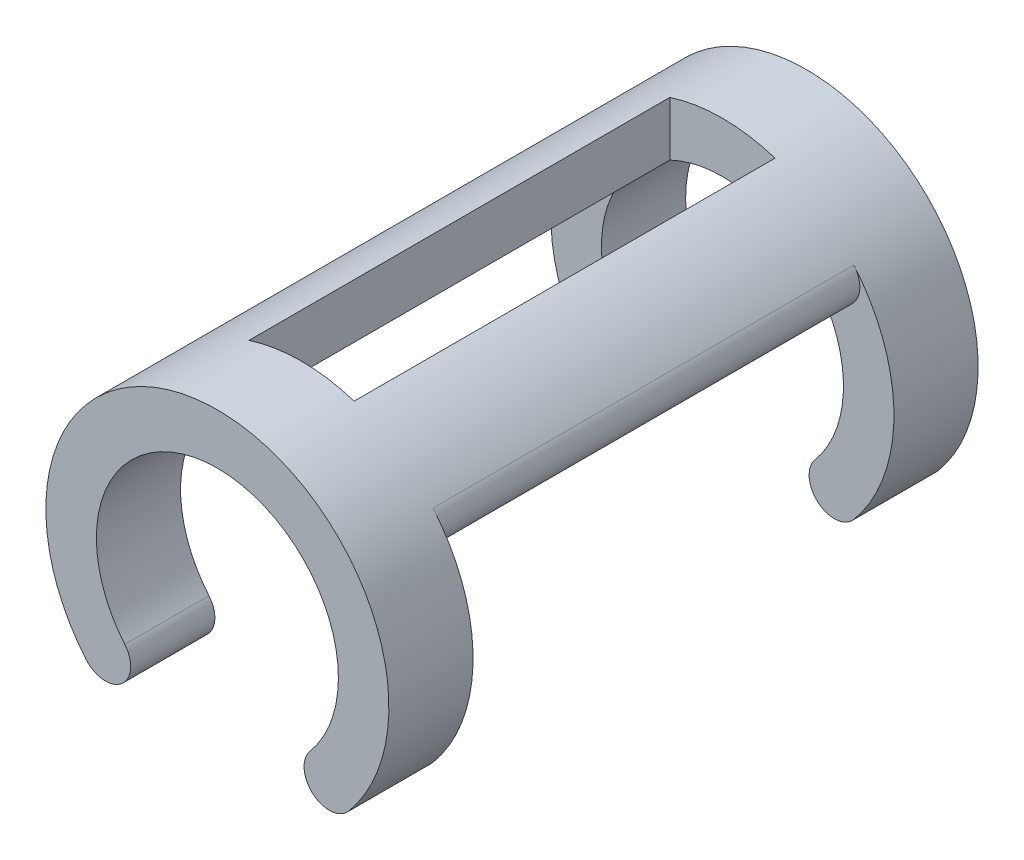
ISO-10303-21;
HEADER;
FILE_DESCRIPTION(('STEP AP214'),'2;1');
FILE_NAME('part.step','',(''),(''),'','','');
FILE_SCHEMA(('AUTOMOTIVE_DESIGN { 1 0 10303 214 1 1 1 1 }'));
ENDSEC;
DATA;
#1=APPLICATION_CONTEXT('core data for automotive mechanical design processes');
#2=APPLICATION_PROTOCOL_DEFINITION('international standard','automotive_design',2000,#1);
#3=PRODUCT_CONTEXT('',#1,'mechanical');
#4=PRODUCT('Part','Part','',(#3));
#5=PRODUCT_RELATED_PRODUCT_CATEGORY('part','',(#4));
#6=PRODUCT_DEFINITION_FORMATION('','',#4);
#7=PRODUCT_DEFINITION_CONTEXT('part definition',#1,'design');
#8=PRODUCT_DEFINITION('design','',#6,#7);
#9=PRODUCT_DEFINITION_SHAPE('','',#8);
#10=(LENGTH_UNIT() NAMED_UNIT(*) SI_UNIT(.MILLI.,.METRE.));
#11=(NAMED_UNIT(*) PLANE_ANGLE_UNIT() SI_UNIT($,.RADIAN.));
#12=(NAMED_UNIT(*) SI_UNIT($,.STERADIAN.) SOLID_ANGLE_UNIT());
#13=UNCERTAINTY_MEASURE_WITH_UNIT(LENGTH_MEASURE(1.E-05),#10,'distance_accuracy_value','');
#14=(GEOMETRIC_REPRESENTATION_CONTEXT(3) GLOBAL_UNCERTAINTY_ASSIGNED_CONTEXT((#13)) GLOBAL_UNIT_ASSIGNED_CONTEXT((#10,
#11,#12)) REPRESENTATION_CONTEXT('',''));
#15=CARTESIAN_POINT('',(0.,0.,0.));
#16=DIRECTION('',(0.,0.,1.));
#17=DIRECTION('',(1.,0.,0.));
#18=AXIS2_PLACEMENT_3D('',#15,#16,#17);
#19=CARTESIAN_POINT('',(0.,0.,7.));
#20=DIRECTION('',(0.,0.,-1.));
#21=DIRECTION('',(-1.,0.,0.));
#22=AXIS2_PLACEMENT_3D('',#19,#20,#21);
#23=CYLINDRICAL_SURFACE('',#22,4.075);
#24=CARTESIAN_POINT('',(0.,0.,5.));
#25=DIRECTION('',(0.,0.,-1.));
#26=DIRECTION('',(-1.,0.,0.));
#27=AXIS2_PLACEMENT_3D('',#24,#25,#26);
#28=CIRCLE('',#27,4.075);
#29=CARTESIAN_POINT('',(-3.11900642441657,-2.62248430394696,5.));
#30=VERTEX_POINT('',#29);
#31=CARTESIAN_POINT('',(-3.12425265641117,2.61623208811981,5.));
#32=VERTEX_POINT('',#31);
#33=EDGE_CURVE('E236',#30,#32,#28,.T.);
#34=ORIENTED_EDGE('',*,*,#33,.F.);
#35=DIRECTION('',(0.,0.,-1.));
#36=VECTOR('',#35,1.);
#37=CARTESIAN_POINT('',(-3.11900642441657,-2.62248430394696,7.));
#38=LINE('',#37,#36);
#39=CARTESIAN_POINT('',(-3.11900642441657,-2.62248430394696,7.));
#40=VERTEX_POINT('',#39);
#41=EDGE_CURVE('E292',#30,#40,#38,.F.);
#42=ORIENTED_EDGE('',*,*,#41,.T.);
#43=CARTESIAN_POINT('',(0.,0.,7.));
#44=DIRECTION('',(0.,0.,1.));
#45=DIRECTION('',(1.,0.,0.));
#46=AXIS2_PLACEMENT_3D('',#43,#44,#45);
#47=CIRCLE('',#46,4.075);
#48=CARTESIAN_POINT('',(3.11900642441657,-2.62248430394696,7.));
#49=VERTEX_POINT('',#48);
#50=EDGE_CURVE('E250',#49,#40,#47,.T.);
#51=ORIENTED_EDGE('',*,*,#50,.F.);
#52=DIRECTION('',(0.,0.,-1.));
#53=VECTOR('',#52,1.);
#54=CARTESIAN_POINT('',(3.11900642441657,-2.62248430394696,7.));
#55=LINE('',#54,#53);
#56=CARTESIAN_POINT('',(3.11900642441657,-2.62248430394696,5.));
#57=VERTEX_POINT('',#56);
#58=EDGE_CURVE('E288',#49,#57,#55,.T.);
#59=ORIENTED_EDGE('',*,*,#58,.T.);
#60=CARTESIAN_POINT('',(3.12425265641117,2.61623208811981,5.));
#61=VERTEX_POINT('',#60);
#62=EDGE_CURVE('E231',#61,#57,#28,.T.);
#63=ORIENTED_EDGE('',*,*,#62,.F.);
#64=DIRECTION('',(0.,0.,-1.));
#65=VECTOR('',#64,1.);
#66=CARTESIAN_POINT('',(3.12425265641117,2.61623208811981,7.));
#67=LINE('',#66,#65);
#68=CARTESIAN_POINT('',(3.12425265641117,2.61623208811981,-5.));
#69=VERTEX_POINT('',#68);
#70=EDGE_CURVE('E273',#61,#69,#67,.T.);
#71=ORIENTED_EDGE('',*,*,#70,.T.);
#72=CARTESIAN_POINT('',(0.,0.,-5.));
#73=DIRECTION('',(0.,0.,-1.));
#74=DIRECTION('',(-1.,0.,0.));
#75=AXIS2_PLACEMENT_3D('',#72,#73,#74);
#76=CIRCLE('',#75,4.075);
#77=CARTESIAN_POINT('',(3.11900642441657,-2.62248430394696,-5.));
#78=VERTEX_POINT('',#77);
#79=EDGE_CURVE('E237',#69,#78,#76,.T.);
#80=ORIENTED_EDGE('',*,*,#79,.T.);
#81=DIRECTION('',(0.,0.,-1.));
#82=VECTOR('',#81,1.);
#83=CARTESIAN_POINT('',(3.11900642441657,-2.62248430394696,7.));
#84=LINE('',#83,#82);
#85=CARTESIAN_POINT('',(3.11900642441657,-2.62248430394696,-7.));
#86=VERTEX_POINT('',#85);
#87=EDGE_CURVE('E281',#78,#86,#84,.T.);
#88=ORIENTED_EDGE('',*,*,#87,.T.);
#89=CARTESIAN_POINT('',(0.,0.,-7.));
#90=DIRECTION('',(0.,0.,1.));
#91=DIRECTION('',(1.,0.,0.));
#92=AXIS2_PLACEMENT_3D('',#89,#90,#91);
#93=CIRCLE('',#92,4.075);
#94=CARTESIAN_POINT('',(-3.11900642441657,-2.62248430394696,-7.));
#95=VERTEX_POINT('',#94);
#96=EDGE_CURVE('E246',#86,#95,#93,.T.);
#97=ORIENTED_EDGE('',*,*,#96,.T.);
#98=DIRECTION('',(0.,0.,-1.));
#99=VECTOR('',#98,1.);
#100=CARTESIAN_POINT('',(-3.11900642441657,-2.62248430394696,7.));
#101=LINE('',#100,#99);
#102=CARTESIAN_POINT('',(-3.11900642441657,-2.62248430394696,-5.));
#103=VERTEX_POINT('',#102);
#104=EDGE_CURVE('E284',#95,#103,#101,.F.);
#105=ORIENTED_EDGE('',*,*,#104,.T.);
#106=CARTESIAN_POINT('',(-3.12425265641117,2.61623208811981,-5.));
#107=VERTEX_POINT('',#106);
#108=EDGE_CURVE('E235',#103,#107,#76,.T.);
#109=ORIENTED_EDGE('',*,*,#108,.T.);
#110=DIRECTION('',(0.,0.,-1.));
#111=VECTOR('',#110,1.);
#112=CARTESIAN_POINT('',(-3.12425265641117,2.61623208811981,7.));
#113=LINE('',#112,#111);
#114=EDGE_CURVE('E277',#107,#32,#113,.F.);
#115=ORIENTED_EDGE('',*,*,#114,.T.);
#116=EDGE_LOOP('',(#34,#42,#51,#59,#63,#71,#80,#88,#97,#105,#109,#115));
#117=FACE_BOUND('',#116,.T.);
#118=CARTESIAN_POINT('',(0.,0.,-5.));
#119=DIRECTION('',(0.,0.,1.));
#120=DIRECTION('',(1.,0.,0.));
#121=AXIS2_PLACEMENT_3D('',#118,#119,#120);
#122=CIRCLE('',#121,4.075);
#123=CARTESIAN_POINT('',(1.25,3.87854676393105,-5.));
#124=VERTEX_POINT('',#123);
#125=CARTESIAN_POINT('',(-1.25,3.87854676393105,-5.));
#126=VERTEX_POINT('',#125);
#127=EDGE_CURVE('E209',#124,#126,#122,.T.);
#128=ORIENTED_EDGE('',*,*,#127,.F.);
#129=DIRECTION('',(0.,0.,-1.));
#130=VECTOR('',#129,1.);
#131=CARTESIAN_POINT('',(1.25,3.87854676393105,7.));
#132=LINE('',#131,#130);
#133=CARTESIAN_POINT('',(1.25,3.87854676393105,5.));
#134=VERTEX_POINT('',#133);
#135=EDGE_CURVE('E197',#134,#124,#132,.T.);
#136=ORIENTED_EDGE('',*,*,#135,.F.);
#137=CARTESIAN_POINT('',(0.,0.,5.));
#138=DIRECTION('',(0.,0.,-1.));
#139=DIRECTION('',(-1.,0.,0.));
#140=AXIS2_PLACEMENT_3D('',#137,#138,#139);
#141=CIRCLE('',#140,4.075);
#142=CARTESIAN_POINT('',(-1.25,3.87854676393105,5.));
#143=VERTEX_POINT('',#142);
#144=EDGE_CURVE('E208',#143,#134,#141,.T.);
#145=ORIENTED_EDGE('',*,*,#144,.F.);
#146=DIRECTION('',(0.,0.,-1.));
#147=VECTOR('',#146,1.);
#148=CARTESIAN_POINT('',(-1.25,3.87854676393105,7.));
#149=LINE('',#148,#147);
#150=EDGE_CURVE('E217',#126,#143,#149,.F.);
#151=ORIENTED_EDGE('',*,*,#150,.F.);
#152=EDGE_LOOP('',(#128,#136,#145,#151));
#153=FACE_BOUND('',#152,.T.);
#154=ADVANCED_FACE('F45',(#117,#153),#23,.T.);
#155=CARTESIAN_POINT('',(0.,0.,7.));
#156=DIRECTION('',(0.,0.,-1.));
#157=DIRECTION('',(-1.,0.,0.));
#158=AXIS2_PLACEMENT_3D('',#155,#156,#157);
#159=CYLINDRICAL_SURFACE('',#158,2.875);
#160=CARTESIAN_POINT('',(0.,0.,7.));
#161=DIRECTION('',(0.,0.,1.));
#162=DIRECTION('',(1.,0.,0.));
#163=AXIS2_PLACEMENT_3D('',#160,#161,#162);
#164=CIRCLE('',#163,2.875);
#165=CARTESIAN_POINT('',(2.20052600495647,-1.85021898744724,7.));
#166=VERTEX_POINT('',#165);
#167=CARTESIAN_POINT('',(-2.20052600495647,-1.85021898744724,7.));
#168=VERTEX_POINT('',#167);
#169=EDGE_CURVE('E242',#166,#168,#164,.T.);
#170=ORIENTED_EDGE('',*,*,#169,.T.);
#171=DIRECTION('',(0.,0.,-1.));
#172=VECTOR('',#171,1.);
#173=CARTESIAN_POINT('',(-2.20052600495647,-1.85021898744724,7.));
#174=LINE('',#173,#172);
#175=CARTESIAN_POINT('',(-2.20052600495647,-1.85021898744724,5.));
#176=VERTEX_POINT('',#175);
#177=EDGE_CURVE('E326',#168,#176,#174,.T.);
#178=ORIENTED_EDGE('',*,*,#177,.T.);
#179=CARTESIAN_POINT('',(0.,0.,5.));
#180=DIRECTION('',(0.,0.,-1.));
#181=DIRECTION('',(-1.,0.,0.));
#182=AXIS2_PLACEMENT_3D('',#179,#180,#181);
#183=CIRCLE('',#182,2.875);
#184=CARTESIAN_POINT('',(-2.20422733427782,1.84580791493115,5.));
#185=VERTEX_POINT('',#184);
#186=EDGE_CURVE('E254',#176,#185,#183,.T.);
#187=ORIENTED_EDGE('',*,*,#186,.T.);
#188=DIRECTION('',(0.,0.,-1.));
#189=VECTOR('',#188,1.);
#190=CARTESIAN_POINT('',(-2.20422733427782,1.84580791493115,7.));
#191=LINE('',#190,#189);
#192=CARTESIAN_POINT('',(-2.20422733427782,1.84580791493115,-5.));
#193=VERTEX_POINT('',#192);
#194=EDGE_CURVE('E312',#185,#193,#191,.T.);
#195=ORIENTED_EDGE('',*,*,#194,.T.);
#196=CARTESIAN_POINT('',(0.,0.,-5.));
#197=DIRECTION('',(0.,0.,-1.));
#198=DIRECTION('',(-1.,0.,0.));
#199=AXIS2_PLACEMENT_3D('',#196,#197,#198);
#200=CIRCLE('',#199,2.875);
#201=CARTESIAN_POINT('',(-2.20052600495647,-1.85021898744724,-5.));
#202=VERTEX_POINT('',#201);
#203=EDGE_CURVE('E262',#202,#193,#200,.T.);
#204=ORIENTED_EDGE('',*,*,#203,.F.);
#205=DIRECTION('',(0.,0.,-1.));
#206=VECTOR('',#205,1.);
#207=CARTESIAN_POINT('',(-2.20052600495647,-1.85021898744724,7.));
#208=LINE('',#207,#206);
#209=CARTESIAN_POINT('',(-2.20052600495647,-1.85021898744724,-7.));
#210=VERTEX_POINT('',#209);
#211=EDGE_CURVE('E320',#202,#210,#208,.T.);
#212=ORIENTED_EDGE('',*,*,#211,.T.);
#213=CARTESIAN_POINT('',(0.,0.,-7.));
#214=DIRECTION('',(0.,0.,1.));
#215=DIRECTION('',(1.,0.,0.));
#216=AXIS2_PLACEMENT_3D('',#213,#214,#215);
#217=CIRCLE('',#216,2.875);
#218=CARTESIAN_POINT('',(2.20052600495647,-1.85021898744724,-7.));
#219=VERTEX_POINT('',#218);
#220=EDGE_CURVE('E241',#219,#210,#217,.T.);
#221=ORIENTED_EDGE('',*,*,#220,.F.);
#222=DIRECTION('',(0.,0.,-1.));
#223=VECTOR('',#222,1.);
#224=CARTESIAN_POINT('',(2.20052600495647,-1.85021898744724,7.));
#225=LINE('',#224,#223);
#226=CARTESIAN_POINT('',(2.20052600495647,-1.85021898744724,-5.));
#227=VERTEX_POINT('',#226);
#228=EDGE_CURVE('E316',#219,#227,#225,.F.);
#229=ORIENTED_EDGE('',*,*,#228,.T.);
#230=CARTESIAN_POINT('',(2.20422733427782,1.84580791493115,-5.));
#231=VERTEX_POINT('',#230);
#232=EDGE_CURVE('E263',#231,#227,#200,.T.);
#233=ORIENTED_EDGE('',*,*,#232,.F.);
#234=DIRECTION('',(0.,0.,-1.));
#235=VECTOR('',#234,1.);
#236=CARTESIAN_POINT('',(2.20422733427782,1.84580791493115,7.));
#237=LINE('',#236,#235);
#238=CARTESIAN_POINT('',(2.20422733427782,1.84580791493115,5.));
#239=VERTEX_POINT('',#238);
#240=EDGE_CURVE('E308',#231,#239,#237,.F.);
#241=ORIENTED_EDGE('',*,*,#240,.T.);
#242=CARTESIAN_POINT('',(2.20052600495647,-1.85021898744724,5.));
#243=VERTEX_POINT('',#242);
#244=EDGE_CURVE('E258',#239,#243,#183,.T.);
#245=ORIENTED_EDGE('',*,*,#244,.T.);
#246=DIRECTION('',(0.,0.,-1.));
#247=VECTOR('',#246,1.);
#248=CARTESIAN_POINT('',(2.20052600495647,-1.85021898744724,7.));
#249=LINE('',#248,#247);
#250=EDGE_CURVE('E323',#243,#166,#249,.F.);
#251=ORIENTED_EDGE('',*,*,#250,.T.);
#252=EDGE_LOOP('',(#170,#178,#187,#195,#204,#212,#221,#229,#233,#241,#245,#251));
#253=FACE_BOUND('',#252,.T.);
#254=CARTESIAN_POINT('',(0.,0.,-5.));
#255=DIRECTION('',(0.,0.,1.));
#256=DIRECTION('',(1.,0.,0.));
#257=AXIS2_PLACEMENT_3D('',#254,#255,#256);
#258=CIRCLE('',#257,2.875);
#259=CARTESIAN_POINT('',(1.25,2.589039397151,-5.));
#260=VERTEX_POINT('',#259);
#261=CARTESIAN_POINT('',(-1.25,2.589039397151,-5.));
#262=VERTEX_POINT('',#261);
#263=EDGE_CURVE('E213',#260,#262,#258,.T.);
#264=ORIENTED_EDGE('',*,*,#263,.T.);
#265=DIRECTION('',(0.,0.,-1.));
#266=VECTOR('',#265,1.);
#267=CARTESIAN_POINT('',(-1.25,2.589039397151,7.));
#268=LINE('',#267,#266);
#269=CARTESIAN_POINT('',(-1.25,2.589039397151,5.));
#270=VERTEX_POINT('',#269);
#271=EDGE_CURVE('E11',#262,#270,#268,.F.);
#272=ORIENTED_EDGE('',*,*,#271,.T.);
#273=CARTESIAN_POINT('',(0.,0.,5.));
#274=DIRECTION('',(0.,0.,-1.));
#275=DIRECTION('',(-1.,0.,0.));
#276=AXIS2_PLACEMENT_3D('',#273,#274,#275);
#277=CIRCLE('',#276,2.875);
#278=CARTESIAN_POINT('',(1.25,2.589039397151,5.));
#279=VERTEX_POINT('',#278);
#280=EDGE_CURVE('E54',#270,#279,#277,.T.);
#281=ORIENTED_EDGE('',*,*,#280,.T.);
#282=DIRECTION('',(0.,0.,-1.));
#283=VECTOR('',#282,1.);
#284=CARTESIAN_POINT('',(1.25,2.589039397151,7.));
#285=LINE('',#284,#283);
#286=EDGE_CURVE('E410',#279,#260,#285,.T.);
#287=ORIENTED_EDGE('',*,*,#286,.T.);
#288=EDGE_LOOP('',(#264,#272,#281,#287));
#289=FACE_BOUND('',#288,.T.);
#290=ADVANCED_FACE('F415',(#253,#289),#159,.F.);
#291=CARTESIAN_POINT('',(0.,0.,-5.));
#292=DIRECTION('',(0.,0.,-1.));
#293=DIRECTION('',(-1.,0.,0.));
#294=AXIS2_PLACEMENT_3D('',#291,#292,#293);
#295=PLANE('',#294);
#296=ORIENTED_EDGE('',*,*,#108,.F.);
#297=CARTESIAN_POINT('',(-2.65976621468652,-2.2363516456971,-5.));
#298=DIRECTION('',(0.,0.,-1.));
#299=DIRECTION('',(-1.,0.,0.));
#300=AXIS2_PLACEMENT_3D('',#297,#298,#299);
#301=CIRCLE('',#300,0.6);
#302=CARTESIAN_POINT('',(-2.20013954881513,-2.62202421150903,-5.));
#303=VERTEX_POINT('',#302);
#304=EDGE_CURVE('E350',#103,#303,#301,.F.);
#305=ORIENTED_EDGE('',*,*,#304,.T.);
#306=CARTESIAN_POINT('',(-2.65976621468652,-2.2363516456971,-5.));
#307=DIRECTION('',(0.,0.,-1.));
#308=DIRECTION('',(-1.,0.,0.));
#309=AXIS2_PLACEMENT_3D('',#306,#307,#308);
#310=CIRCLE('',#309,0.6);
#311=EDGE_CURVE('E347',#303,#202,#310,.F.);
#312=ORIENTED_EDGE('',*,*,#311,.T.);
#313=ORIENTED_EDGE('',*,*,#203,.T.);
#314=CARTESIAN_POINT('',(-2.6642399953445,2.23102000152548,-5.));
#315=DIRECTION('',(0.,0.,-1.));
#316=DIRECTION('',(-1.,0.,0.));
#317=AXIS2_PLACEMENT_3D('',#314,#315,#316);
#318=CIRCLE('',#317,0.6);
#319=CARTESIAN_POINT('',(-2.9642399953445,1.71140475925482,-5.));
#320=VERTEX_POINT('',#319);
#321=EDGE_CURVE('E366',#193,#320,#318,.T.);
#322=ORIENTED_EDGE('',*,*,#321,.T.);
#323=CARTESIAN_POINT('',(-2.6642399953445,2.23102000152548,-5.));
#324=DIRECTION('',(0.,0.,-1.));
#325=DIRECTION('',(-1.,0.,0.));
#326=AXIS2_PLACEMENT_3D('',#323,#324,#325);
#327=CIRCLE('',#326,0.6);
#328=EDGE_CURVE('E362',#320,#107,#327,.T.);
#329=ORIENTED_EDGE('',*,*,#328,.T.);
#330=EDGE_LOOP('',(#296,#305,#312,#313,#322,#329));
#331=FACE_BOUND('',#330,.T.);
#332=ADVANCED_FACE('F440',(#331),#295,.F.);
#333=CARTESIAN_POINT('',(0.,0.,5.));
#334=DIRECTION('',(0.,0.,-1.));
#335=DIRECTION('',(-1.,0.,0.));
#336=AXIS2_PLACEMENT_3D('',#333,#334,#335);
#337=PLANE('',#336);
#338=CARTESIAN_POINT('',(-2.65976621468652,-2.2363516456971,5.));
#339=DIRECTION('',(0.,0.,-1.));
#340=DIRECTION('',(-1.,0.,0.));
#341=AXIS2_PLACEMENT_3D('',#338,#339,#340);
#342=CIRCLE('',#341,0.6);
#343=CARTESIAN_POINT('',(-2.20013954881513,-2.62202421150903,5.));
#344=VERTEX_POINT('',#343);
#345=EDGE_CURVE('E267',#176,#344,#342,.T.);
#346=ORIENTED_EDGE('',*,*,#345,.T.);
#347=CARTESIAN_POINT('',(-2.65976621468652,-2.2363516456971,5.));
#348=DIRECTION('',(0.,0.,-1.));
#349=DIRECTION('',(-1.,0.,0.));
#350=AXIS2_PLACEMENT_3D('',#347,#348,#349);
#351=CIRCLE('',#350,0.6);
#352=EDGE_CURVE('E270',#344,#30,#351,.T.);
#353=ORIENTED_EDGE('',*,*,#352,.T.);
#354=ORIENTED_EDGE('',*,*,#33,.T.);
#355=CARTESIAN_POINT('',(-2.6642399953445,2.23102000152548,5.));
#356=DIRECTION('',(0.,0.,-1.));
#357=DIRECTION('',(-1.,0.,0.));
#358=AXIS2_PLACEMENT_3D('',#355,#356,#357);
#359=CIRCLE('',#358,0.6);
#360=CARTESIAN_POINT('',(-2.9642399953445,1.71140475925482,5.));
#361=VERTEX_POINT('',#360);
#362=EDGE_CURVE('E359',#32,#361,#359,.F.);
#363=ORIENTED_EDGE('',*,*,#362,.T.);
#364=CARTESIAN_POINT('',(-2.6642399953445,2.23102000152548,5.));
#365=DIRECTION('',(0.,0.,-1.));
#366=DIRECTION('',(-1.,0.,0.));
#367=AXIS2_PLACEMENT_3D('',#364,#365,#366);
#368=CIRCLE('',#367,0.6);
#369=EDGE_CURVE('E369',#361,#185,#368,.F.);
#370=ORIENTED_EDGE('',*,*,#369,.T.);
#371=ORIENTED_EDGE('',*,*,#186,.F.);
#372=EDGE_LOOP('',(#346,#353,#354,#363,#370,#371));
#373=FACE_BOUND('',#372,.T.);
#374=ADVANCED_FACE('F508',(#373),#337,.T.);
#375=CARTESIAN_POINT('',(0.,0.,7.));
#376=DIRECTION('',(0.,0.,1.));
#377=DIRECTION('',(1.,0.,0.));
#378=AXIS2_PLACEMENT_3D('',#375,#376,#377);
#379=PLANE('',#378);
#380=ORIENTED_EDGE('',*,*,#50,.T.);
#381=CARTESIAN_POINT('',(-2.65976621468652,-2.2363516456971,7.));
#382=DIRECTION('',(0.,0.,1.));
#383=DIRECTION('',(1.,0.,0.));
#384=AXIS2_PLACEMENT_3D('',#381,#382,#383);
#385=CIRCLE('',#384,0.6);
#386=CARTESIAN_POINT('',(-2.20013954881513,-2.62202421150903,7.));
#387=VERTEX_POINT('',#386);
#388=EDGE_CURVE('E305',#40,#387,#385,.T.);
#389=ORIENTED_EDGE('',*,*,#388,.T.);
#390=CARTESIAN_POINT('',(-2.65976621468652,-2.2363516456971,7.));
#391=DIRECTION('',(0.,0.,1.));
#392=DIRECTION('',(1.,0.,0.));
#393=AXIS2_PLACEMENT_3D('',#390,#391,#392);
#394=CIRCLE('',#393,0.6);
#395=EDGE_CURVE('E302',#387,#168,#394,.T.);
#396=ORIENTED_EDGE('',*,*,#395,.T.);
#397=ORIENTED_EDGE('',*,*,#169,.F.);
#398=CARTESIAN_POINT('',(2.65976621468652,-2.2363516456971,7.));
#399=DIRECTION('',(0.,0.,1.));
#400=DIRECTION('',(1.,0.,0.));
#401=AXIS2_PLACEMENT_3D('',#398,#399,#400);
#402=CIRCLE('',#401,0.6);
#403=CARTESIAN_POINT('',(2.20013954881513,-2.62202421150903,7.));
#404=VERTEX_POINT('',#403);
#405=EDGE_CURVE('E296',#166,#404,#402,.T.);
#406=ORIENTED_EDGE('',*,*,#405,.T.);
#407=CARTESIAN_POINT('',(2.65976621468652,-2.2363516456971,7.));
#408=DIRECTION('',(0.,0.,1.));
#409=DIRECTION('',(1.,0.,0.));
#410=AXIS2_PLACEMENT_3D('',#407,#408,#409);
#411=CIRCLE('',#410,0.6);
#412=EDGE_CURVE('E299',#404,#49,#411,.T.);
#413=ORIENTED_EDGE('',*,*,#412,.T.);
#414=EDGE_LOOP('',(#380,#389,#396,#397,#406,#413));
#415=FACE_BOUND('',#414,.T.);
#416=ADVANCED_FACE('F537',(#415),#379,.T.);
#417=CARTESIAN_POINT('',(0.,0.,-7.));
#418=DIRECTION('',(0.,0.,1.));
#419=DIRECTION('',(1.,0.,0.));
#420=AXIS2_PLACEMENT_3D('',#417,#418,#419);
#421=PLANE('',#420);
#422=CARTESIAN_POINT('',(-2.65976621468652,-2.2363516456971,-7.));
#423=DIRECTION('',(0.,0.,1.));
#424=DIRECTION('',(1.,0.,0.));
#425=AXIS2_PLACEMENT_3D('',#422,#423,#424);
#426=CIRCLE('',#425,0.6);
#427=CARTESIAN_POINT('',(-2.20013954881513,-2.62202421150903,-7.));
#428=VERTEX_POINT('',#427);
#429=EDGE_CURVE('E341',#210,#428,#426,.F.);
#430=ORIENTED_EDGE('',*,*,#429,.T.);
#431=CARTESIAN_POINT('',(-2.65976621468652,-2.2363516456971,-7.));
#432=DIRECTION('',(0.,0.,1.));
#433=DIRECTION('',(1.,0.,0.));
#434=AXIS2_PLACEMENT_3D('',#431,#432,#433);
#435=CIRCLE('',#434,0.6);
#436=EDGE_CURVE('E344',#428,#95,#435,.F.);
#437=ORIENTED_EDGE('',*,*,#436,.T.);
#438=ORIENTED_EDGE('',*,*,#96,.F.);
#439=CARTESIAN_POINT('',(2.65976621468652,-2.2363516456971,-7.));
#440=DIRECTION('',(0.,0.,1.));
#441=DIRECTION('',(1.,0.,0.));
#442=AXIS2_PLACEMENT_3D('',#439,#440,#441);
#443=CIRCLE('',#442,0.6);
#444=CARTESIAN_POINT('',(2.20013954881513,-2.62202421150903,-7.));
#445=VERTEX_POINT('',#444);
#446=EDGE_CURVE('E335',#86,#445,#443,.F.);
#447=ORIENTED_EDGE('',*,*,#446,.T.);
#448=CARTESIAN_POINT('',(2.65976621468652,-2.2363516456971,-7.));
#449=DIRECTION('',(0.,0.,1.));
#450=DIRECTION('',(1.,0.,0.));
#451=AXIS2_PLACEMENT_3D('',#448,#449,#450);
#452=CIRCLE('',#451,0.6);
#453=EDGE_CURVE('E338',#445,#219,#452,.F.);
#454=ORIENTED_EDGE('',*,*,#453,.T.);
#455=ORIENTED_EDGE('',*,*,#220,.T.);
#456=EDGE_LOOP('',(#430,#437,#438,#447,#454,#455));
#457=FACE_BOUND('',#456,.T.);
#458=ADVANCED_FACE('F446',(#457),#421,.F.);
#459=ORIENTED_EDGE('',*,*,#232,.T.);
#460=CARTESIAN_POINT('',(2.65976621468652,-2.2363516456971,-5.));
#461=DIRECTION('',(0.,0.,-1.));
#462=DIRECTION('',(-1.,0.,0.));
#463=AXIS2_PLACEMENT_3D('',#460,#461,#462);
#464=CIRCLE('',#463,0.6);
#465=CARTESIAN_POINT('',(2.20013954881513,-2.62202421150903,-5.));
#466=VERTEX_POINT('',#465);
#467=EDGE_CURVE('E356',#227,#466,#464,.F.);
#468=ORIENTED_EDGE('',*,*,#467,.T.);
#469=CARTESIAN_POINT('',(2.65976621468652,-2.2363516456971,-5.));
#470=DIRECTION('',(0.,0.,-1.));
#471=DIRECTION('',(-1.,0.,0.));
#472=AXIS2_PLACEMENT_3D('',#469,#470,#471);
#473=CIRCLE('',#472,0.6);
#474=EDGE_CURVE('E353',#466,#78,#473,.F.);
#475=ORIENTED_EDGE('',*,*,#474,.T.);
#476=ORIENTED_EDGE('',*,*,#79,.F.);
#477=CARTESIAN_POINT('',(2.6642399953445,2.23102000152548,-5.));
#478=DIRECTION('',(0.,0.,-1.));
#479=DIRECTION('',(-1.,0.,0.));
#480=AXIS2_PLACEMENT_3D('',#477,#478,#479);
#481=CIRCLE('',#480,0.6);
#482=CARTESIAN_POINT('',(2.9642399953445,1.71140475925482,-5.));
#483=VERTEX_POINT('',#482);
#484=EDGE_CURVE('E69',#69,#483,#481,.T.);
#485=ORIENTED_EDGE('',*,*,#484,.T.);
#486=CARTESIAN_POINT('',(2.6642399953445,2.23102000152548,-5.));
#487=DIRECTION('',(0.,0.,-1.));
#488=DIRECTION('',(-1.,0.,0.));
#489=AXIS2_PLACEMENT_3D('',#486,#487,#488);
#490=CIRCLE('',#489,0.6);
#491=EDGE_CURVE('E382',#483,#231,#490,.T.);
#492=ORIENTED_EDGE('',*,*,#491,.T.);
#493=EDGE_LOOP('',(#459,#468,#475,#476,#485,#492));
#494=FACE_BOUND('',#493,.T.);
#495=ADVANCED_FACE('F523',(#494),#295,.F.);
#496=ORIENTED_EDGE('',*,*,#62,.T.);
#497=CARTESIAN_POINT('',(2.65976621468652,-2.2363516456971,5.));
#498=DIRECTION('',(0.,0.,-1.));
#499=DIRECTION('',(-1.,0.,0.));
#500=AXIS2_PLACEMENT_3D('',#497,#498,#499);
#501=CIRCLE('',#500,0.6);
#502=CARTESIAN_POINT('',(2.20013954881513,-2.62202421150903,5.));
#503=VERTEX_POINT('',#502);
#504=EDGE_CURVE('E332',#57,#503,#501,.T.);
#505=ORIENTED_EDGE('',*,*,#504,.T.);
#506=CARTESIAN_POINT('',(2.65976621468652,-2.2363516456971,5.));
#507=DIRECTION('',(0.,0.,-1.));
#508=DIRECTION('',(-1.,0.,0.));
#509=AXIS2_PLACEMENT_3D('',#506,#507,#508);
#510=CIRCLE('',#509,0.6);
#511=EDGE_CURVE('E329',#503,#243,#510,.T.);
#512=ORIENTED_EDGE('',*,*,#511,.T.);
#513=ORIENTED_EDGE('',*,*,#244,.F.);
#514=CARTESIAN_POINT('',(2.6642399953445,2.23102000152548,5.));
#515=DIRECTION('',(0.,0.,-1.));
#516=DIRECTION('',(-1.,0.,0.));
#517=AXIS2_PLACEMENT_3D('',#514,#515,#516);
#518=CIRCLE('',#517,0.6);
#519=CARTESIAN_POINT('',(2.9642399953445,1.71140475925482,5.));
#520=VERTEX_POINT('',#519);
#521=EDGE_CURVE('E379',#239,#520,#518,.F.);
#522=ORIENTED_EDGE('',*,*,#521,.T.);
#523=CARTESIAN_POINT('',(2.6642399953445,2.23102000152548,5.));
#524=DIRECTION('',(0.,0.,-1.));
#525=DIRECTION('',(-1.,0.,0.));
#526=AXIS2_PLACEMENT_3D('',#523,#524,#525);
#527=CIRCLE('',#526,0.6);
#528=EDGE_CURVE('E373',#520,#61,#527,.F.);
#529=ORIENTED_EDGE('',*,*,#528,.T.);
#530=EDGE_LOOP('',(#496,#505,#512,#513,#522,#529));
#531=FACE_BOUND('',#530,.T.);
#532=ADVANCED_FACE('F456',(#531),#337,.T.);
#533=CARTESIAN_POINT('',(-2.65976621468652,-2.2363516456971,7.));
#534=DIRECTION('',(0.,0.,-1.));
#535=DIRECTION('',(-1.,0.,0.));
#536=AXIS2_PLACEMENT_3D('',#533,#534,#535);
#537=CYLINDRICAL_SURFACE('',#536,0.6);
#538=ORIENTED_EDGE('',*,*,#177,.F.);
#539=ORIENTED_EDGE('',*,*,#395,.F.);
#540=DIRECTION('',(0.,0.,1.));
#541=VECTOR('',#540,1.);
#542=CARTESIAN_POINT('',(-2.20013954881513,-2.62202421150903,7.));
#543=LINE('',#542,#541);
#544=EDGE_CURVE('E385',#344,#387,#543,.T.);
#545=ORIENTED_EDGE('',*,*,#544,.F.);
#546=ORIENTED_EDGE('',*,*,#345,.F.);
#547=EDGE_LOOP('',(#538,#539,#545,#546));
#548=FACE_BOUND('',#547,.T.);
#549=ADVANCED_FACE('F452',(#548),#537,.T.);
#550=CARTESIAN_POINT('',(-2.65976621468652,-2.2363516456971,7.));
#551=DIRECTION('',(0.,0.,-1.));
#552=DIRECTION('',(-1.,0.,0.));
#553=AXIS2_PLACEMENT_3D('',#550,#551,#552);
#554=CYLINDRICAL_SURFACE('',#553,0.6);
#555=ORIENTED_EDGE('',*,*,#388,.F.);
#556=ORIENTED_EDGE('',*,*,#41,.F.);
#557=ORIENTED_EDGE('',*,*,#352,.F.);
#558=ORIENTED_EDGE('',*,*,#544,.T.);
#559=EDGE_LOOP('',(#555,#556,#557,#558));
#560=FACE_BOUND('',#559,.T.);
#561=ADVANCED_FACE('F448',(#560),#554,.T.);
#562=CARTESIAN_POINT('',(2.65976621468652,-2.2363516456971,7.));
#563=DIRECTION('',(0.,0.,-1.));
#564=DIRECTION('',(-1.,0.,0.));
#565=AXIS2_PLACEMENT_3D('',#562,#563,#564);
#566=CYLINDRICAL_SURFACE('',#565,0.6);
#567=DIRECTION('',(0.,0.,1.));
#568=VECTOR('',#567,1.);
#569=CARTESIAN_POINT('',(2.20013954881513,-2.62202421150903,5.));
#570=LINE('',#569,#568);
#571=EDGE_CURVE('E389',#404,#503,#570,.F.);
#572=ORIENTED_EDGE('',*,*,#571,.F.);
#573=ORIENTED_EDGE('',*,*,#405,.F.);
#574=ORIENTED_EDGE('',*,*,#250,.F.);
#575=ORIENTED_EDGE('',*,*,#511,.F.);
#576=EDGE_LOOP('',(#572,#573,#574,#575));
#577=FACE_BOUND('',#576,.T.);
#578=ADVANCED_FACE('F451',(#577),#566,.T.);
#579=CARTESIAN_POINT('',(2.65976621468652,-2.2363516456971,7.));
#580=DIRECTION('',(0.,0.,-1.));
#581=DIRECTION('',(-1.,0.,0.));
#582=AXIS2_PLACEMENT_3D('',#579,#580,#581);
#583=CYLINDRICAL_SURFACE('',#582,0.6);
#584=ORIENTED_EDGE('',*,*,#412,.F.);
#585=ORIENTED_EDGE('',*,*,#571,.T.);
#586=ORIENTED_EDGE('',*,*,#504,.F.);
#587=ORIENTED_EDGE('',*,*,#58,.F.);
#588=EDGE_LOOP('',(#584,#585,#586,#587));
#589=FACE_BOUND('',#588,.T.);
#590=ADVANCED_FACE('F458',(#589),#583,.T.);
#591=CARTESIAN_POINT('',(-2.65976621468652,-2.2363516456971,7.));
#592=DIRECTION('',(0.,0.,-1.));
#593=DIRECTION('',(-1.,0.,0.));
#594=AXIS2_PLACEMENT_3D('',#591,#592,#593);
#595=CYLINDRICAL_SURFACE('',#594,0.6);
#596=ORIENTED_EDGE('',*,*,#211,.F.);
#597=ORIENTED_EDGE('',*,*,#311,.F.);
#598=DIRECTION('',(0.,0.,1.));
#599=VECTOR('',#598,1.);
#600=CARTESIAN_POINT('',(-2.20013954881513,-2.62202421150903,-5.));
#601=LINE('',#600,#599);
#602=EDGE_CURVE('E393',#428,#303,#601,.T.);
#603=ORIENTED_EDGE('',*,*,#602,.F.);
#604=ORIENTED_EDGE('',*,*,#429,.F.);
#605=EDGE_LOOP('',(#596,#597,#603,#604));
#606=FACE_BOUND('',#605,.T.);
#607=ADVANCED_FACE('F461',(#606),#595,.T.);
#608=CARTESIAN_POINT('',(-2.65976621468652,-2.2363516456971,7.));
#609=DIRECTION('',(0.,0.,-1.));
#610=DIRECTION('',(-1.,0.,0.));
#611=AXIS2_PLACEMENT_3D('',#608,#609,#610);
#612=CYLINDRICAL_SURFACE('',#611,0.6);
#613=ORIENTED_EDGE('',*,*,#304,.F.);
#614=ORIENTED_EDGE('',*,*,#104,.F.);
#615=ORIENTED_EDGE('',*,*,#436,.F.);
#616=ORIENTED_EDGE('',*,*,#602,.T.);
#617=EDGE_LOOP('',(#613,#614,#615,#616));
#618=FACE_BOUND('',#617,.T.);
#619=ADVANCED_FACE('F466',(#618),#612,.T.);
#620=CARTESIAN_POINT('',(2.65976621468652,-2.2363516456971,7.));
#621=DIRECTION('',(0.,0.,-1.));
#622=DIRECTION('',(-1.,0.,0.));
#623=AXIS2_PLACEMENT_3D('',#620,#621,#622);
#624=CYLINDRICAL_SURFACE('',#623,0.6);
#625=ORIENTED_EDGE('',*,*,#87,.F.);
#626=ORIENTED_EDGE('',*,*,#474,.F.);
#627=DIRECTION('',(0.,0.,-1.));
#628=VECTOR('',#627,1.);
#629=CARTESIAN_POINT('',(2.20013954881513,-2.62202421150903,7.));
#630=LINE('',#629,#628);
#631=EDGE_CURVE('E397',#445,#466,#630,.F.);
#632=ORIENTED_EDGE('',*,*,#631,.F.);
#633=ORIENTED_EDGE('',*,*,#446,.F.);
#634=EDGE_LOOP('',(#625,#626,#632,#633));
#635=FACE_BOUND('',#634,.T.);
#636=ADVANCED_FACE('F469',(#635),#624,.T.);
#637=CARTESIAN_POINT('',(2.65976621468652,-2.2363516456971,7.));
#638=DIRECTION('',(0.,0.,-1.));
#639=DIRECTION('',(-1.,0.,0.));
#640=AXIS2_PLACEMENT_3D('',#637,#638,#639);
#641=CYLINDRICAL_SURFACE('',#640,0.6);
#642=ORIENTED_EDGE('',*,*,#467,.F.);
#643=ORIENTED_EDGE('',*,*,#228,.F.);
#644=ORIENTED_EDGE('',*,*,#453,.F.);
#645=ORIENTED_EDGE('',*,*,#631,.T.);
#646=EDGE_LOOP('',(#642,#643,#644,#645));
#647=FACE_BOUND('',#646,.T.);
#648=ADVANCED_FACE('F474',(#647),#641,.T.);
#649=CARTESIAN_POINT('',(-2.6642399953445,2.23102000152548,7.));
#650=DIRECTION('',(0.,0.,-1.));
#651=DIRECTION('',(-1.,0.,0.));
#652=AXIS2_PLACEMENT_3D('',#649,#650,#651);
#653=CYLINDRICAL_SURFACE('',#652,0.6);
#654=DIRECTION('',(0.,0.,-1.));
#655=VECTOR('',#654,1.);
#656=CARTESIAN_POINT('',(-2.9642399953445,1.71140475925482,-5.));
#657=LINE('',#656,#655);
#658=EDGE_CURVE('E401',#320,#361,#657,.F.);
#659=ORIENTED_EDGE('',*,*,#658,.F.);
#660=ORIENTED_EDGE('',*,*,#321,.F.);
#661=ORIENTED_EDGE('',*,*,#194,.F.);
#662=ORIENTED_EDGE('',*,*,#369,.F.);
#663=EDGE_LOOP('',(#659,#660,#661,#662));
#664=FACE_BOUND('',#663,.T.);
#665=ADVANCED_FACE('F477',(#664),#653,.T.);
#666=CARTESIAN_POINT('',(-2.6642399953445,2.23102000152548,7.));
#667=DIRECTION('',(0.,0.,-1.));
#668=DIRECTION('',(-1.,0.,0.));
#669=AXIS2_PLACEMENT_3D('',#666,#667,#668);
#670=CYLINDRICAL_SURFACE('',#669,0.6);
#671=ORIENTED_EDGE('',*,*,#328,.F.);
#672=ORIENTED_EDGE('',*,*,#658,.T.);
#673=ORIENTED_EDGE('',*,*,#362,.F.);
#674=ORIENTED_EDGE('',*,*,#114,.F.);
#675=EDGE_LOOP('',(#671,#672,#673,#674));
#676=FACE_BOUND('',#675,.T.);
#677=ADVANCED_FACE('F482',(#676),#670,.T.);
#678=CARTESIAN_POINT('',(2.6642399953445,2.23102000152548,7.));
#679=DIRECTION('',(0.,0.,-1.));
#680=DIRECTION('',(-1.,0.,0.));
#681=AXIS2_PLACEMENT_3D('',#678,#679,#680);
#682=CYLINDRICAL_SURFACE('',#681,0.6);
#683=ORIENTED_EDGE('',*,*,#240,.F.);
#684=ORIENTED_EDGE('',*,*,#491,.F.);
#685=DIRECTION('',(0.,0.,-1.));
#686=VECTOR('',#685,1.);
#687=CARTESIAN_POINT('',(2.9642399953445,1.71140475925482,-5.));
#688=LINE('',#687,#686);
#689=EDGE_CURVE('E230',#520,#483,#688,.T.);
#690=ORIENTED_EDGE('',*,*,#689,.F.);
#691=ORIENTED_EDGE('',*,*,#521,.F.);
#692=EDGE_LOOP('',(#683,#684,#690,#691));
#693=FACE_BOUND('',#692,.T.);
#694=ADVANCED_FACE('F47',(#693),#682,.T.);
#695=CARTESIAN_POINT('',(2.6642399953445,2.23102000152548,7.));
#696=DIRECTION('',(0.,0.,-1.));
#697=DIRECTION('',(-1.,0.,0.));
#698=AXIS2_PLACEMENT_3D('',#695,#696,#697);
#699=CYLINDRICAL_SURFACE('',#698,0.6);
#700=ORIENTED_EDGE('',*,*,#484,.F.);
#701=ORIENTED_EDGE('',*,*,#70,.F.);
#702=ORIENTED_EDGE('',*,*,#528,.F.);
#703=ORIENTED_EDGE('',*,*,#689,.T.);
#704=EDGE_LOOP('',(#700,#701,#702,#703));
#705=FACE_BOUND('',#704,.T.);
#706=ADVANCED_FACE('F425',(#705),#699,.T.);
#707=CARTESIAN_POINT('',(-1.25,4.075,-5.));
#708=DIRECTION('',(1.,0.,0.));
#709=DIRECTION('',(0.,0.,-1.));
#710=AXIS2_PLACEMENT_3D('',#707,#708,#709);
#711=PLANE('',#710);
#712=ORIENTED_EDGE('',*,*,#150,.T.);
#713=DIRECTION('',(0.,-1.,0.));
#714=VECTOR('',#713,1.);
#715=CARTESIAN_POINT('',(-1.25,4.075,5.));
#716=LINE('',#715,#714);
#717=EDGE_CURVE('E219',#143,#270,#716,.T.);
#718=ORIENTED_EDGE('',*,*,#717,.T.);
#719=ORIENTED_EDGE('',*,*,#271,.F.);
#720=DIRECTION('',(0.,-1.,0.));
#721=VECTOR('',#720,1.);
#722=CARTESIAN_POINT('',(-1.25,4.075,-5.));
#723=LINE('',#722,#721);
#724=EDGE_CURVE('E61',#126,#262,#723,.T.);
#725=ORIENTED_EDGE('',*,*,#724,.F.);
#726=EDGE_LOOP('',(#712,#718,#719,#725));
#727=FACE_BOUND('',#726,.T.);
#728=ADVANCED_FACE('F420',(#727),#711,.T.);
#729=CARTESIAN_POINT('',(-1.25,4.075,5.));
#730=DIRECTION('',(0.,0.,-1.));
#731=DIRECTION('',(-1.,0.,0.));
#732=AXIS2_PLACEMENT_3D('',#729,#730,#731);
#733=PLANE('',#732);
#734=ORIENTED_EDGE('',*,*,#144,.T.);
#735=DIRECTION('',(0.,-1.,0.));
#736=VECTOR('',#735,1.);
#737=CARTESIAN_POINT('',(1.25,4.075,5.));
#738=LINE('',#737,#736);
#739=EDGE_CURVE('E203',#134,#279,#738,.T.);
#740=ORIENTED_EDGE('',*,*,#739,.T.);
#741=ORIENTED_EDGE('',*,*,#280,.F.);
#742=ORIENTED_EDGE('',*,*,#717,.F.);
#743=EDGE_LOOP('',(#734,#740,#741,#742));
#744=FACE_BOUND('',#743,.T.);
#745=ADVANCED_FACE('F418',(#744),#733,.T.);
#746=CARTESIAN_POINT('',(1.25,4.075,-5.));
#747=DIRECTION('',(-1.,0.,0.));
#748=DIRECTION('',(0.,0.,1.));
#749=AXIS2_PLACEMENT_3D('',#746,#747,#748);
#750=PLANE('',#749);
#751=ORIENTED_EDGE('',*,*,#135,.T.);
#752=DIRECTION('',(0.,-1.,0.));
#753=VECTOR('',#752,1.);
#754=CARTESIAN_POINT('',(1.25,4.075,-5.));
#755=LINE('',#754,#753);
#756=EDGE_CURVE('E200',#124,#260,#755,.T.);
#757=ORIENTED_EDGE('',*,*,#756,.T.);
#758=ORIENTED_EDGE('',*,*,#286,.F.);
#759=ORIENTED_EDGE('',*,*,#739,.F.);
#760=EDGE_LOOP('',(#751,#757,#758,#759));
#761=FACE_BOUND('',#760,.T.);
#762=ADVANCED_FACE('F199',(#761),#750,.T.);
#763=CARTESIAN_POINT('',(-1.25,4.075,-5.));
#764=DIRECTION('',(0.,0.,1.));
#765=DIRECTION('',(1.,0.,0.));
#766=AXIS2_PLACEMENT_3D('',#763,#764,#765);
#767=PLANE('',#766);
#768=ORIENTED_EDGE('',*,*,#127,.T.);
#769=ORIENTED_EDGE('',*,*,#724,.T.);
#770=ORIENTED_EDGE('',*,*,#263,.F.);
#771=ORIENTED_EDGE('',*,*,#756,.F.);
#772=EDGE_LOOP('',(#768,#769,#770,#771));
#773=FACE_BOUND('',#772,.T.);
#774=ADVANCED_FACE('F211',(#773),#767,.T.);
#775=CLOSED_SHELL('',(#154,#290,#332,#374,#416,#458,#495,#532,#549,#561,#578,#590,#607,#619,
#636,#648,#665,#677,#694,#706,#728,#745,#762,#774));
#776=MANIFOLD_SOLID_BREP('B2',#775);
#777=ADVANCED_BREP_SHAPE_REPRESENTATION('',(#18,#776),#14);
#778=SHAPE_DEFINITION_REPRESENTATION(#9,#777);
ENDSEC;
END-ISO-10303-21;
